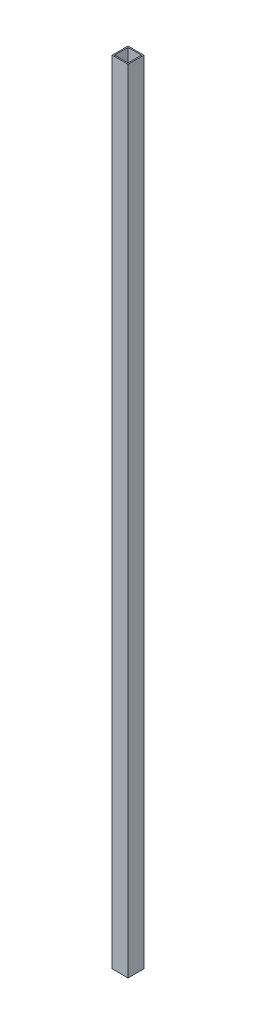
ISO-10303-21;
HEADER;
FILE_DESCRIPTION(('STEP AP214'),'2;1');
FILE_NAME('part.step','',(''),(''),'','','');
FILE_SCHEMA(('AUTOMOTIVE_DESIGN { 1 0 10303 214 1 1 1 1 }'));
ENDSEC;
DATA;
#1=APPLICATION_CONTEXT('core data for automotive mechanical design processes');
#2=APPLICATION_PROTOCOL_DEFINITION('international standard','automotive_design',2000,#1);
#3=PRODUCT_CONTEXT('',#1,'mechanical');
#4=PRODUCT('Part','Part','',(#3));
#5=PRODUCT_RELATED_PRODUCT_CATEGORY('part','',(#4));
#6=PRODUCT_DEFINITION_FORMATION('','',#4);
#7=PRODUCT_DEFINITION_CONTEXT('part definition',#1,'design');
#8=PRODUCT_DEFINITION('design','',#6,#7);
#9=PRODUCT_DEFINITION_SHAPE('','',#8);
#10=(LENGTH_UNIT() NAMED_UNIT(*) SI_UNIT(.MILLI.,.METRE.));
#11=(NAMED_UNIT(*) PLANE_ANGLE_UNIT() SI_UNIT($,.RADIAN.));
#12=(NAMED_UNIT(*) SI_UNIT($,.STERADIAN.) SOLID_ANGLE_UNIT());
#13=UNCERTAINTY_MEASURE_WITH_UNIT(LENGTH_MEASURE(1.E-05),#10,'distance_accuracy_value','');
#14=(GEOMETRIC_REPRESENTATION_CONTEXT(3) GLOBAL_UNCERTAINTY_ASSIGNED_CONTEXT((#13)) GLOBAL_UNIT_ASSIGNED_CONTEXT((#10,
#11,#12)) REPRESENTATION_CONTEXT('',''));
#15=CARTESIAN_POINT('',(0.,0.,0.));
#16=DIRECTION('',(0.,0.,1.));
#17=DIRECTION('',(1.,0.,0.));
#18=AXIS2_PLACEMENT_3D('',#15,#16,#17);
#19=CARTESIAN_POINT('',(0.,1000.,0.));
#20=DIRECTION('',(0.,-1.,0.));
#21=DIRECTION('',(0.,0.,-1.));
#22=AXIS2_PLACEMENT_3D('',#19,#20,#21);
#23=PLANE('',#22);
#24=DIRECTION('',(0.,0.,1.));
#25=VECTOR('',#24,1.);
#26=CARTESIAN_POINT('',(0.,1000.,0.));
#27=LINE('',#26,#25);
#28=CARTESIAN_POINT('',(0.,1000.,-20.));
#29=VERTEX_POINT('',#28);
#30=CARTESIAN_POINT('',(0.,1000.,0.));
#31=VERTEX_POINT('',#30);
#32=EDGE_CURVE('E134',#29,#31,#27,.T.);
#33=ORIENTED_EDGE('',*,*,#32,.T.);
#34=DIRECTION('',(1.,0.,0.));
#35=VECTOR('',#34,1.);
#36=CARTESIAN_POINT('',(0.,1000.,0.));
#37=LINE('',#36,#35);
#38=CARTESIAN_POINT('',(20.,1000.,0.));
#39=VERTEX_POINT('',#38);
#40=EDGE_CURVE('E137',#31,#39,#37,.T.);
#41=ORIENTED_EDGE('',*,*,#40,.T.);
#42=DIRECTION('',(0.,0.,-1.));
#43=VECTOR('',#42,1.);
#44=CARTESIAN_POINT('',(20.,1000.,0.));
#45=LINE('',#44,#43);
#46=CARTESIAN_POINT('',(20.,1000.,-20.));
#47=VERTEX_POINT('',#46);
#48=EDGE_CURVE('E140',#39,#47,#45,.T.);
#49=ORIENTED_EDGE('',*,*,#48,.T.);
#50=DIRECTION('',(-1.,0.,0.));
#51=VECTOR('',#50,1.);
#52=CARTESIAN_POINT('',(0.,1000.,-20.));
#53=LINE('',#52,#51);
#54=EDGE_CURVE('E142',#47,#29,#53,.T.);
#55=ORIENTED_EDGE('',*,*,#54,.T.);
#56=EDGE_LOOP('',(#33,#41,#49,#55));
#57=FACE_BOUND('',#56,.T.);
#58=DIRECTION('',(0.,0.,1.));
#59=VECTOR('',#58,1.);
#60=CARTESIAN_POINT('',(1.45,1000.,-1.45));
#61=LINE('',#60,#59);
#62=CARTESIAN_POINT('',(1.45,1000.,-18.55));
#63=VERTEX_POINT('',#62);
#64=CARTESIAN_POINT('',(1.45,1000.,-1.45));
#65=VERTEX_POINT('',#64);
#66=EDGE_CURVE('E98',#63,#65,#61,.T.);
#67=ORIENTED_EDGE('',*,*,#66,.F.);
#68=DIRECTION('',(-1.,0.,0.));
#69=VECTOR('',#68,1.);
#70=CARTESIAN_POINT('',(1.45,1000.,-18.55));
#71=LINE('',#70,#69);
#72=CARTESIAN_POINT('',(18.55,1000.,-18.55));
#73=VERTEX_POINT('',#72);
#74=EDGE_CURVE('E120',#73,#63,#71,.T.);
#75=ORIENTED_EDGE('',*,*,#74,.F.);
#76=DIRECTION('',(0.,0.,-1.));
#77=VECTOR('',#76,1.);
#78=CARTESIAN_POINT('',(18.55,1000.,-1.45));
#79=LINE('',#78,#77);
#80=CARTESIAN_POINT('',(18.55,1000.,-1.45));
#81=VERTEX_POINT('',#80);
#82=EDGE_CURVE('E118',#81,#73,#79,.T.);
#83=ORIENTED_EDGE('',*,*,#82,.F.);
#84=DIRECTION('',(1.,0.,0.));
#85=VECTOR('',#84,1.);
#86=CARTESIAN_POINT('',(1.45,1000.,-1.45));
#87=LINE('',#86,#85);
#88=EDGE_CURVE('E106',#65,#81,#87,.T.);
#89=ORIENTED_EDGE('',*,*,#88,.F.);
#90=EDGE_LOOP('',(#67,#75,#83,#89));
#91=FACE_BOUND('',#90,.T.);
#92=ADVANCED_FACE('F33',(#57,#91),#23,.F.);
#93=CARTESIAN_POINT('',(0.,0.,0.));
#94=DIRECTION('',(0.,-1.,0.));
#95=DIRECTION('',(0.,0.,-1.));
#96=AXIS2_PLACEMENT_3D('',#93,#94,#95);
#97=PLANE('',#96);
#98=DIRECTION('',(0.,0.,1.));
#99=VECTOR('',#98,1.);
#100=CARTESIAN_POINT('',(0.,0.,0.));
#101=LINE('',#100,#99);
#102=CARTESIAN_POINT('',(0.,0.,-20.));
#103=VERTEX_POINT('',#102);
#104=CARTESIAN_POINT('',(0.,0.,0.));
#105=VERTEX_POINT('',#104);
#106=EDGE_CURVE('E114',#103,#105,#101,.T.);
#107=ORIENTED_EDGE('',*,*,#106,.F.);
#108=DIRECTION('',(-1.,0.,0.));
#109=VECTOR('',#108,1.);
#110=CARTESIAN_POINT('',(0.,0.,-20.));
#111=LINE('',#110,#109);
#112=CARTESIAN_POINT('',(20.,0.,-20.));
#113=VERTEX_POINT('',#112);
#114=EDGE_CURVE('E138',#113,#103,#111,.T.);
#115=ORIENTED_EDGE('',*,*,#114,.F.);
#116=DIRECTION('',(0.,0.,-1.));
#117=VECTOR('',#116,1.);
#118=CARTESIAN_POINT('',(20.,0.,0.));
#119=LINE('',#118,#117);
#120=CARTESIAN_POINT('',(20.,0.,0.));
#121=VERTEX_POINT('',#120);
#122=EDGE_CURVE('E149',#121,#113,#119,.T.);
#123=ORIENTED_EDGE('',*,*,#122,.F.);
#124=DIRECTION('',(1.,0.,0.));
#125=VECTOR('',#124,1.);
#126=CARTESIAN_POINT('',(0.,0.,0.));
#127=LINE('',#126,#125);
#128=EDGE_CURVE('E147',#105,#121,#127,.T.);
#129=ORIENTED_EDGE('',*,*,#128,.F.);
#130=EDGE_LOOP('',(#107,#115,#123,#129));
#131=FACE_BOUND('',#130,.T.);
#132=DIRECTION('',(-1.,0.,0.));
#133=VECTOR('',#132,1.);
#134=CARTESIAN_POINT('',(1.45,0.,-18.55));
#135=LINE('',#134,#133);
#136=CARTESIAN_POINT('',(18.55,0.,-18.55));
#137=VERTEX_POINT('',#136);
#138=CARTESIAN_POINT('',(1.45,0.,-18.55));
#139=VERTEX_POINT('',#138);
#140=EDGE_CURVE('E107',#137,#139,#135,.T.);
#141=ORIENTED_EDGE('',*,*,#140,.T.);
#142=DIRECTION('',(0.,0.,1.));
#143=VECTOR('',#142,1.);
#144=CARTESIAN_POINT('',(1.45,0.,-1.45));
#145=LINE('',#144,#143);
#146=CARTESIAN_POINT('',(1.45,0.,-1.45));
#147=VERTEX_POINT('',#146);
#148=EDGE_CURVE('E56',#139,#147,#145,.T.);
#149=ORIENTED_EDGE('',*,*,#148,.T.);
#150=DIRECTION('',(1.,0.,0.));
#151=VECTOR('',#150,1.);
#152=CARTESIAN_POINT('',(1.45,0.,-1.45));
#153=LINE('',#152,#151);
#154=CARTESIAN_POINT('',(18.55,0.,-1.45));
#155=VERTEX_POINT('',#154);
#156=EDGE_CURVE('E113',#147,#155,#153,.T.);
#157=ORIENTED_EDGE('',*,*,#156,.T.);
#158=DIRECTION('',(0.,0.,-1.));
#159=VECTOR('',#158,1.);
#160=CARTESIAN_POINT('',(18.55,0.,-1.45));
#161=LINE('',#160,#159);
#162=EDGE_CURVE('E126',#155,#137,#161,.T.);
#163=ORIENTED_EDGE('',*,*,#162,.T.);
#164=EDGE_LOOP('',(#141,#149,#157,#163));
#165=FACE_BOUND('',#164,.T.);
#166=ADVANCED_FACE('F167',(#131,#165),#97,.T.);
#167=CARTESIAN_POINT('',(0.,1000.,0.));
#168=DIRECTION('',(1.,0.,0.));
#169=DIRECTION('',(0.,0.,-1.));
#170=AXIS2_PLACEMENT_3D('',#167,#168,#169);
#171=PLANE('',#170);
#172=ORIENTED_EDGE('',*,*,#106,.T.);
#173=DIRECTION('',(0.,-1.,0.));
#174=VECTOR('',#173,1.);
#175=CARTESIAN_POINT('',(0.,1000.,0.));
#176=LINE('',#175,#174);
#177=EDGE_CURVE('E11',#31,#105,#176,.T.);
#178=ORIENTED_EDGE('',*,*,#177,.F.);
#179=ORIENTED_EDGE('',*,*,#32,.F.);
#180=DIRECTION('',(0.,-1.,0.));
#181=VECTOR('',#180,1.);
#182=CARTESIAN_POINT('',(0.,1000.,-20.));
#183=LINE('',#182,#181);
#184=EDGE_CURVE('E144',#29,#103,#183,.T.);
#185=ORIENTED_EDGE('',*,*,#184,.T.);
#186=EDGE_LOOP('',(#172,#178,#179,#185));
#187=FACE_BOUND('',#186,.T.);
#188=ADVANCED_FACE('F35',(#187),#171,.F.);
#189=CARTESIAN_POINT('',(0.,1000.,0.));
#190=DIRECTION('',(0.,0.,-1.));
#191=DIRECTION('',(-1.,0.,0.));
#192=AXIS2_PLACEMENT_3D('',#189,#190,#191);
#193=PLANE('',#192);
#194=ORIENTED_EDGE('',*,*,#128,.T.);
#195=DIRECTION('',(0.,-1.,0.));
#196=VECTOR('',#195,1.);
#197=CARTESIAN_POINT('',(20.,1000.,0.));
#198=LINE('',#197,#196);
#199=EDGE_CURVE('E41',#39,#121,#198,.T.);
#200=ORIENTED_EDGE('',*,*,#199,.F.);
#201=ORIENTED_EDGE('',*,*,#40,.F.);
#202=ORIENTED_EDGE('',*,*,#177,.T.);
#203=EDGE_LOOP('',(#194,#200,#201,#202));
#204=FACE_BOUND('',#203,.T.);
#205=ADVANCED_FACE('F177',(#204),#193,.F.);
#206=CARTESIAN_POINT('',(20.,1000.,0.));
#207=DIRECTION('',(-1.,0.,0.));
#208=DIRECTION('',(0.,0.,1.));
#209=AXIS2_PLACEMENT_3D('',#206,#207,#208);
#210=PLANE('',#209);
#211=ORIENTED_EDGE('',*,*,#122,.T.);
#212=DIRECTION('',(0.,-1.,0.));
#213=VECTOR('',#212,1.);
#214=CARTESIAN_POINT('',(20.,1000.,-20.));
#215=LINE('',#214,#213);
#216=EDGE_CURVE('E154',#47,#113,#215,.T.);
#217=ORIENTED_EDGE('',*,*,#216,.F.);
#218=ORIENTED_EDGE('',*,*,#48,.F.);
#219=ORIENTED_EDGE('',*,*,#199,.T.);
#220=EDGE_LOOP('',(#211,#217,#218,#219));
#221=FACE_BOUND('',#220,.T.);
#222=ADVANCED_FACE('F161',(#221),#210,.F.);
#223=CARTESIAN_POINT('',(0.,1000.,-20.));
#224=DIRECTION('',(0.,0.,1.));
#225=DIRECTION('',(1.,0.,0.));
#226=AXIS2_PLACEMENT_3D('',#223,#224,#225);
#227=PLANE('',#226);
#228=ORIENTED_EDGE('',*,*,#114,.T.);
#229=ORIENTED_EDGE('',*,*,#184,.F.);
#230=ORIENTED_EDGE('',*,*,#54,.F.);
#231=ORIENTED_EDGE('',*,*,#216,.T.);
#232=EDGE_LOOP('',(#228,#229,#230,#231));
#233=FACE_BOUND('',#232,.T.);
#234=ADVANCED_FACE('F171',(#233),#227,.F.);
#235=CARTESIAN_POINT('',(1.45,1000.,-1.45));
#236=DIRECTION('',(1.,0.,0.));
#237=DIRECTION('',(0.,0.,-1.));
#238=AXIS2_PLACEMENT_3D('',#235,#236,#237);
#239=PLANE('',#238);
#240=ORIENTED_EDGE('',*,*,#148,.F.);
#241=DIRECTION('',(0.,-1.,0.));
#242=VECTOR('',#241,1.);
#243=CARTESIAN_POINT('',(1.45,1000.,-18.55));
#244=LINE('',#243,#242);
#245=EDGE_CURVE('E102',#63,#139,#244,.T.);
#246=ORIENTED_EDGE('',*,*,#245,.F.);
#247=ORIENTED_EDGE('',*,*,#66,.T.);
#248=DIRECTION('',(0.,-1.,0.));
#249=VECTOR('',#248,1.);
#250=CARTESIAN_POINT('',(1.45,1000.,-1.45));
#251=LINE('',#250,#249);
#252=EDGE_CURVE('E101',#65,#147,#251,.T.);
#253=ORIENTED_EDGE('',*,*,#252,.T.);
#254=EDGE_LOOP('',(#240,#246,#247,#253));
#255=FACE_BOUND('',#254,.T.);
#256=ADVANCED_FACE('F100',(#255),#239,.T.);
#257=CARTESIAN_POINT('',(1.45,1000.,-1.45));
#258=DIRECTION('',(0.,0.,-1.));
#259=DIRECTION('',(-1.,0.,0.));
#260=AXIS2_PLACEMENT_3D('',#257,#258,#259);
#261=PLANE('',#260);
#262=ORIENTED_EDGE('',*,*,#156,.F.);
#263=ORIENTED_EDGE('',*,*,#252,.F.);
#264=ORIENTED_EDGE('',*,*,#88,.T.);
#265=DIRECTION('',(0.,-1.,0.));
#266=VECTOR('',#265,1.);
#267=CARTESIAN_POINT('',(18.55,1000.,-1.45));
#268=LINE('',#267,#266);
#269=EDGE_CURVE('E115',#81,#155,#268,.T.);
#270=ORIENTED_EDGE('',*,*,#269,.T.);
#271=EDGE_LOOP('',(#262,#263,#264,#270));
#272=FACE_BOUND('',#271,.T.);
#273=ADVANCED_FACE('F110',(#272),#261,.T.);
#274=CARTESIAN_POINT('',(18.55,1000.,-1.45));
#275=DIRECTION('',(-1.,0.,0.));
#276=DIRECTION('',(0.,0.,1.));
#277=AXIS2_PLACEMENT_3D('',#274,#275,#276);
#278=PLANE('',#277);
#279=ORIENTED_EDGE('',*,*,#162,.F.);
#280=ORIENTED_EDGE('',*,*,#269,.F.);
#281=ORIENTED_EDGE('',*,*,#82,.T.);
#282=DIRECTION('',(0.,-1.,0.));
#283=VECTOR('',#282,1.);
#284=CARTESIAN_POINT('',(18.55,1000.,-18.55));
#285=LINE('',#284,#283);
#286=EDGE_CURVE('E48',#73,#137,#285,.T.);
#287=ORIENTED_EDGE('',*,*,#286,.T.);
#288=EDGE_LOOP('',(#279,#280,#281,#287));
#289=FACE_BOUND('',#288,.T.);
#290=ADVANCED_FACE('F200',(#289),#278,.T.);
#291=CARTESIAN_POINT('',(1.45,1000.,-18.55));
#292=DIRECTION('',(0.,0.,1.));
#293=DIRECTION('',(1.,0.,0.));
#294=AXIS2_PLACEMENT_3D('',#291,#292,#293);
#295=PLANE('',#294);
#296=ORIENTED_EDGE('',*,*,#140,.F.);
#297=ORIENTED_EDGE('',*,*,#286,.F.);
#298=ORIENTED_EDGE('',*,*,#74,.T.);
#299=ORIENTED_EDGE('',*,*,#245,.T.);
#300=EDGE_LOOP('',(#296,#297,#298,#299));
#301=FACE_BOUND('',#300,.T.);
#302=ADVANCED_FACE('F204',(#301),#295,.T.);
#303=CLOSED_SHELL('',(#92,#166,#188,#205,#222,#234,#256,#273,#290,#302));
#304=MANIFOLD_SOLID_BREP('B2',#303);
#305=ADVANCED_BREP_SHAPE_REPRESENTATION('',(#18,#304),#14);
#306=SHAPE_DEFINITION_REPRESENTATION(#9,#305);
ENDSEC;
END-ISO-10303-21;
